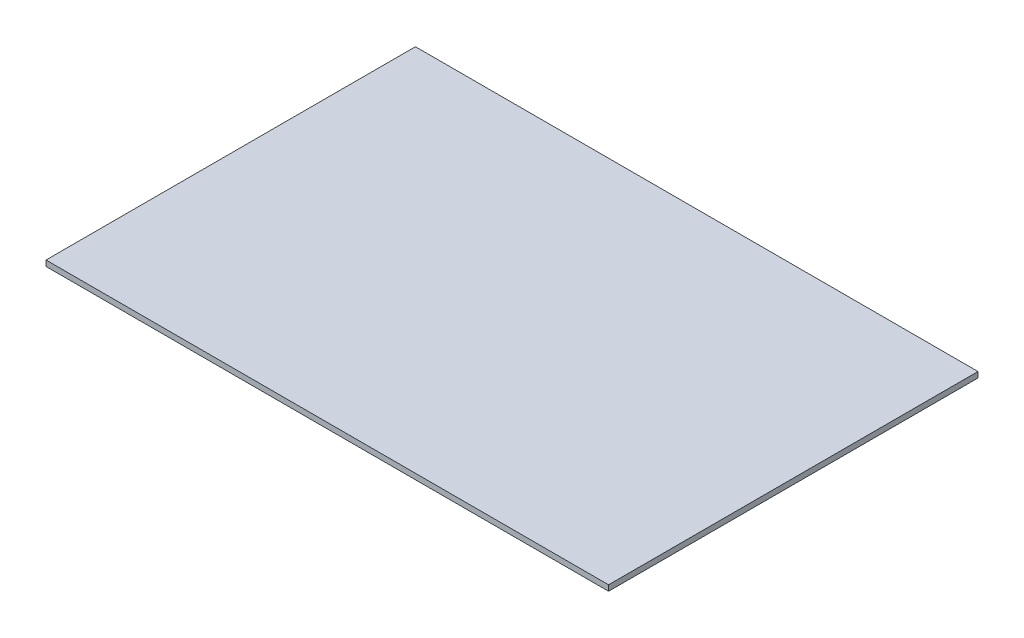
ISO-10303-21;
HEADER;
FILE_DESCRIPTION(('STEP AP214'),'2;1');
FILE_NAME('part.step','',(''),(''),'','','');
FILE_SCHEMA(('AUTOMOTIVE_DESIGN { 1 0 10303 214 1 1 1 1 }'));
ENDSEC;
DATA;
#1=APPLICATION_CONTEXT('core data for automotive mechanical design processes');
#2=APPLICATION_PROTOCOL_DEFINITION('international standard','automotive_design',2000,#1);
#3=PRODUCT_CONTEXT('',#1,'mechanical');
#4=PRODUCT('Part','Part','',(#3));
#5=PRODUCT_RELATED_PRODUCT_CATEGORY('part','',(#4));
#6=PRODUCT_DEFINITION_FORMATION('','',#4);
#7=PRODUCT_DEFINITION_CONTEXT('part definition',#1,'design');
#8=PRODUCT_DEFINITION('design','',#6,#7);
#9=PRODUCT_DEFINITION_SHAPE('','',#8);
#10=(LENGTH_UNIT() NAMED_UNIT(*) SI_UNIT(.MILLI.,.METRE.));
#11=(NAMED_UNIT(*) PLANE_ANGLE_UNIT() SI_UNIT($,.RADIAN.));
#12=(NAMED_UNIT(*) SI_UNIT($,.STERADIAN.) SOLID_ANGLE_UNIT());
#13=UNCERTAINTY_MEASURE_WITH_UNIT(LENGTH_MEASURE(1.E-05),#10,'distance_accuracy_value','');
#14=(GEOMETRIC_REPRESENTATION_CONTEXT(3) GLOBAL_UNCERTAINTY_ASSIGNED_CONTEXT((#13)) GLOBAL_UNIT_ASSIGNED_CONTEXT((#10,
#11,#12)) REPRESENTATION_CONTEXT('',''));
#15=CARTESIAN_POINT('',(0.,0.,0.));
#16=DIRECTION('',(0.,0.,1.));
#17=DIRECTION('',(1.,0.,0.));
#18=AXIS2_PLACEMENT_3D('',#15,#16,#17);
#19=CARTESIAN_POINT('',(150.,3.,98.5));
#20=DIRECTION('',(-1.,0.,0.));
#21=DIRECTION('',(0.,0.,1.));
#22=AXIS2_PLACEMENT_3D('',#19,#20,#21);
#23=PLANE('',#22);
#24=DIRECTION('',(0.,0.,-1.));
#25=VECTOR('',#24,1.);
#26=CARTESIAN_POINT('',(150.,0.,98.5));
#27=LINE('',#26,#25);
#28=CARTESIAN_POINT('',(150.,0.,98.5));
#29=VERTEX_POINT('',#28);
#30=CARTESIAN_POINT('',(150.,0.,-98.5));
#31=VERTEX_POINT('',#30);
#32=EDGE_CURVE('E98',#29,#31,#27,.T.);
#33=ORIENTED_EDGE('',*,*,#32,.T.);
#34=DIRECTION('',(0.,-1.,0.));
#35=VECTOR('',#34,1.);
#36=CARTESIAN_POINT('',(150.,3.,-98.5));
#37=LINE('',#36,#35);
#38=CARTESIAN_POINT('',(150.,3.,-98.5));
#39=VERTEX_POINT('',#38);
#40=EDGE_CURVE('E11',#39,#31,#37,.T.);
#41=ORIENTED_EDGE('',*,*,#40,.F.);
#42=DIRECTION('',(0.,0.,-1.));
#43=VECTOR('',#42,1.);
#44=CARTESIAN_POINT('',(150.,3.,98.5));
#45=LINE('',#44,#43);
#46=CARTESIAN_POINT('',(150.,3.,98.5));
#47=VERTEX_POINT('',#46);
#48=EDGE_CURVE('E86',#47,#39,#45,.T.);
#49=ORIENTED_EDGE('',*,*,#48,.F.);
#50=DIRECTION('',(0.,-1.,0.));
#51=VECTOR('',#50,1.);
#52=CARTESIAN_POINT('',(150.,3.,98.5));
#53=LINE('',#52,#51);
#54=EDGE_CURVE('E94',#47,#29,#53,.T.);
#55=ORIENTED_EDGE('',*,*,#54,.T.);
#56=EDGE_LOOP('',(#33,#41,#49,#55));
#57=FACE_BOUND('',#56,.T.);
#58=ADVANCED_FACE('F35',(#57),#23,.F.);
#59=CARTESIAN_POINT('',(-150.,3.,-98.5));
#60=DIRECTION('',(0.,0.,1.));
#61=DIRECTION('',(1.,0.,0.));
#62=AXIS2_PLACEMENT_3D('',#59,#60,#61);
#63=PLANE('',#62);
#64=DIRECTION('',(-1.,0.,0.));
#65=VECTOR('',#64,1.);
#66=CARTESIAN_POINT('',(-150.,0.,-98.5));
#67=LINE('',#66,#65);
#68=CARTESIAN_POINT('',(-150.,0.,-98.5));
#69=VERTEX_POINT('',#68);
#70=EDGE_CURVE('E90',#31,#69,#67,.T.);
#71=ORIENTED_EDGE('',*,*,#70,.T.);
#72=DIRECTION('',(0.,-1.,0.));
#73=VECTOR('',#72,1.);
#74=CARTESIAN_POINT('',(-150.,3.,-98.5));
#75=LINE('',#74,#73);
#76=CARTESIAN_POINT('',(-150.,3.,-98.5));
#77=VERTEX_POINT('',#76);
#78=EDGE_CURVE('E43',#77,#69,#75,.T.);
#79=ORIENTED_EDGE('',*,*,#78,.F.);
#80=DIRECTION('',(-1.,0.,0.));
#81=VECTOR('',#80,1.);
#82=CARTESIAN_POINT('',(-150.,3.,-98.5));
#83=LINE('',#82,#81);
#84=EDGE_CURVE('E81',#39,#77,#83,.T.);
#85=ORIENTED_EDGE('',*,*,#84,.F.);
#86=ORIENTED_EDGE('',*,*,#40,.T.);
#87=EDGE_LOOP('',(#71,#79,#85,#86));
#88=FACE_BOUND('',#87,.T.);
#89=ADVANCED_FACE('F89',(#88),#63,.F.);
#90=CARTESIAN_POINT('',(-150.,3.,98.5));
#91=DIRECTION('',(1.,0.,0.));
#92=DIRECTION('',(0.,0.,-1.));
#93=AXIS2_PLACEMENT_3D('',#90,#91,#92);
#94=PLANE('',#93);
#95=DIRECTION('',(0.,0.,1.));
#96=VECTOR('',#95,1.);
#97=CARTESIAN_POINT('',(-150.,0.,98.5));
#98=LINE('',#97,#96);
#99=CARTESIAN_POINT('',(-150.,0.,98.5));
#100=VERTEX_POINT('',#99);
#101=EDGE_CURVE('E68',#69,#100,#98,.T.);
#102=ORIENTED_EDGE('',*,*,#101,.T.);
#103=DIRECTION('',(0.,-1.,0.));
#104=VECTOR('',#103,1.);
#105=CARTESIAN_POINT('',(-150.,3.,98.5));
#106=LINE('',#105,#104);
#107=CARTESIAN_POINT('',(-150.,3.,98.5));
#108=VERTEX_POINT('',#107);
#109=EDGE_CURVE('E91',#108,#100,#106,.T.);
#110=ORIENTED_EDGE('',*,*,#109,.F.);
#111=DIRECTION('',(0.,0.,1.));
#112=VECTOR('',#111,1.);
#113=CARTESIAN_POINT('',(-150.,3.,98.5));
#114=LINE('',#113,#112);
#115=EDGE_CURVE('E84',#77,#108,#114,.T.);
#116=ORIENTED_EDGE('',*,*,#115,.F.);
#117=ORIENTED_EDGE('',*,*,#78,.T.);
#118=EDGE_LOOP('',(#102,#110,#116,#117));
#119=FACE_BOUND('',#118,.T.);
#120=ADVANCED_FACE('F92',(#119),#94,.F.);
#121=CARTESIAN_POINT('',(-150.,3.,98.5));
#122=DIRECTION('',(0.,0.,-1.));
#123=DIRECTION('',(-1.,0.,0.));
#124=AXIS2_PLACEMENT_3D('',#121,#122,#123);
#125=PLANE('',#124);
#126=DIRECTION('',(1.,0.,0.));
#127=VECTOR('',#126,1.);
#128=CARTESIAN_POINT('',(-150.,0.,98.5));
#129=LINE('',#128,#127);
#130=EDGE_CURVE('E74',#100,#29,#129,.T.);
#131=ORIENTED_EDGE('',*,*,#130,.T.);
#132=ORIENTED_EDGE('',*,*,#54,.F.);
#133=DIRECTION('',(1.,0.,0.));
#134=VECTOR('',#133,1.);
#135=CARTESIAN_POINT('',(-150.,3.,98.5));
#136=LINE('',#135,#134);
#137=EDGE_CURVE('E51',#108,#47,#136,.T.);
#138=ORIENTED_EDGE('',*,*,#137,.F.);
#139=ORIENTED_EDGE('',*,*,#109,.T.);
#140=EDGE_LOOP('',(#131,#132,#138,#139));
#141=FACE_BOUND('',#140,.T.);
#142=ADVANCED_FACE('F105',(#141),#125,.F.);
#143=CARTESIAN_POINT('',(0.,3.,0.));
#144=DIRECTION('',(0.,-1.,0.));
#145=DIRECTION('',(0.,0.,-1.));
#146=AXIS2_PLACEMENT_3D('',#143,#144,#145);
#147=PLANE('',#146);
#148=ORIENTED_EDGE('',*,*,#48,.T.);
#149=ORIENTED_EDGE('',*,*,#84,.T.);
#150=ORIENTED_EDGE('',*,*,#115,.T.);
#151=ORIENTED_EDGE('',*,*,#137,.T.);
#152=EDGE_LOOP('',(#148,#149,#150,#151));
#153=FACE_BOUND('',#152,.T.);
#154=ADVANCED_FACE('F82',(#153),#147,.F.);
#155=CARTESIAN_POINT('',(0.,0.,0.));
#156=DIRECTION('',(0.,-1.,0.));
#157=DIRECTION('',(0.,0.,-1.));
#158=AXIS2_PLACEMENT_3D('',#155,#156,#157);
#159=PLANE('',#158);
#160=ORIENTED_EDGE('',*,*,#32,.F.);
#161=ORIENTED_EDGE('',*,*,#130,.F.);
#162=ORIENTED_EDGE('',*,*,#101,.F.);
#163=ORIENTED_EDGE('',*,*,#70,.F.);
#164=EDGE_LOOP('',(#160,#161,#162,#163));
#165=FACE_BOUND('',#164,.T.);
#166=ADVANCED_FACE('F108',(#165),#159,.T.);
#167=CLOSED_SHELL('',(#58,#89,#120,#142,#154,#166));
#168=MANIFOLD_SOLID_BREP('B2',#167);
#169=ADVANCED_BREP_SHAPE_REPRESENTATION('',(#18,#168),#14);
#170=SHAPE_DEFINITION_REPRESENTATION(#9,#169);
ENDSEC;
END-ISO-10303-21;
